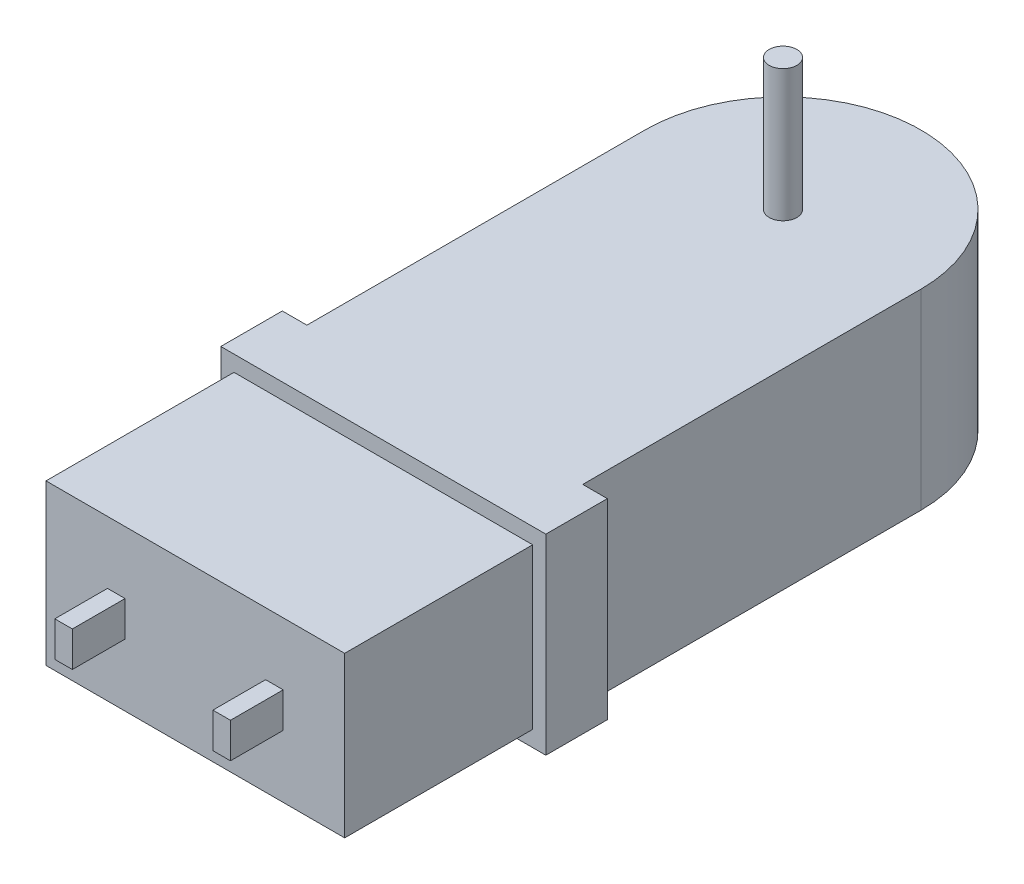
ISO-10303-21;
HEADER;
FILE_DESCRIPTION(('STEP AP214'),'2;1');
FILE_NAME('part.step','',(''),(''),'','','');
FILE_SCHEMA(('AUTOMOTIVE_DESIGN { 1 0 10303 214 1 1 1 1 }'));
ENDSEC;
DATA;
#1=APPLICATION_CONTEXT('core data for automotive mechanical design processes');
#2=APPLICATION_PROTOCOL_DEFINITION('international standard','automotive_design',2000,#1);
#3=PRODUCT_CONTEXT('',#1,'mechanical');
#4=PRODUCT('Part','Part','',(#3));
#5=PRODUCT_RELATED_PRODUCT_CATEGORY('part','',(#4));
#6=PRODUCT_DEFINITION_FORMATION('','',#4);
#7=PRODUCT_DEFINITION_CONTEXT('part definition',#1,'design');
#8=PRODUCT_DEFINITION('design','',#6,#7);
#9=PRODUCT_DEFINITION_SHAPE('','',#8);
#10=(LENGTH_UNIT() NAMED_UNIT(*) SI_UNIT(.MILLI.,.METRE.));
#11=(NAMED_UNIT(*) PLANE_ANGLE_UNIT() SI_UNIT($,.RADIAN.));
#12=(NAMED_UNIT(*) SI_UNIT($,.STERADIAN.) SOLID_ANGLE_UNIT());
#13=UNCERTAINTY_MEASURE_WITH_UNIT(LENGTH_MEASURE(1.E-05),#10,'distance_accuracy_value','');
#14=(GEOMETRIC_REPRESENTATION_CONTEXT(3) GLOBAL_UNCERTAINTY_ASSIGNED_CONTEXT((#13)) GLOBAL_UNIT_ASSIGNED_CONTEXT((#10,
#11,#12)) REPRESENTATION_CONTEXT('',''));
#15=CARTESIAN_POINT('',(0.,0.,0.));
#16=DIRECTION('',(0.,0.,1.));
#17=DIRECTION('',(1.,0.,0.));
#18=AXIS2_PLACEMENT_3D('',#15,#16,#17);
#19=CARTESIAN_POINT('',(5.08,1.27,46.2915));
#20=DIRECTION('',(1.,0.,0.));
#21=DIRECTION('',(0.,0.,-1.));
#22=AXIS2_PLACEMENT_3D('',#19,#20,#21);
#23=PLANE('',#22);
#24=DIRECTION('',(0.,-1.,0.));
#25=VECTOR('',#24,1.);
#26=CARTESIAN_POINT('',(5.08,1.27,42.4815));
#27=LINE('',#26,#25);
#28=CARTESIAN_POINT('',(5.08,1.27,42.4815));
#29=VERTEX_POINT('',#28);
#30=CARTESIAN_POINT('',(5.08,-1.27,42.4815));
#31=VERTEX_POINT('',#30);
#32=EDGE_CURVE('E106',#29,#31,#27,.T.);
#33=ORIENTED_EDGE('',*,*,#32,.T.);
#34=DIRECTION('',(0.,0.,-1.));
#35=VECTOR('',#34,1.);
#36=CARTESIAN_POINT('',(5.08,-1.27,46.2915));
#37=LINE('',#36,#35);
#38=CARTESIAN_POINT('',(5.08,-1.27,46.2915));
#39=VERTEX_POINT('',#38);
#40=EDGE_CURVE('E12',#39,#31,#37,.T.);
#41=ORIENTED_EDGE('',*,*,#40,.F.);
#42=DIRECTION('',(0.,-1.,0.));
#43=VECTOR('',#42,1.);
#44=CARTESIAN_POINT('',(5.08,1.27,46.2915));
#45=LINE('',#44,#43);
#46=CARTESIAN_POINT('',(5.08,1.27,46.2915));
#47=VERTEX_POINT('',#46);
#48=EDGE_CURVE('E94',#47,#39,#45,.T.);
#49=ORIENTED_EDGE('',*,*,#48,.F.);
#50=DIRECTION('',(0.,0.,-1.));
#51=VECTOR('',#50,1.);
#52=CARTESIAN_POINT('',(5.08,1.27,46.2915));
#53=LINE('',#52,#51);
#54=EDGE_CURVE('E102',#47,#29,#53,.T.);
#55=ORIENTED_EDGE('',*,*,#54,.T.);
#56=EDGE_LOOP('',(#33,#41,#49,#55));
#57=FACE_BOUND('',#56,.T.);
#58=ADVANCED_FACE('F43',(#57),#23,.F.);
#59=CARTESIAN_POINT('',(5.08,-1.27,46.2915));
#60=DIRECTION('',(0.,1.,0.));
#61=DIRECTION('',(0.,0.,1.));
#62=AXIS2_PLACEMENT_3D('',#59,#60,#61);
#63=PLANE('',#62);
#64=DIRECTION('',(1.,0.,0.));
#65=VECTOR('',#64,1.);
#66=CARTESIAN_POINT('',(5.08,-1.27,42.4815));
#67=LINE('',#66,#65);
#68=CARTESIAN_POINT('',(6.35,-1.27,42.4815));
#69=VERTEX_POINT('',#68);
#70=EDGE_CURVE('E98',#31,#69,#67,.T.);
#71=ORIENTED_EDGE('',*,*,#70,.T.);
#72=DIRECTION('',(0.,0.,-1.));
#73=VECTOR('',#72,1.);
#74=CARTESIAN_POINT('',(6.35,-1.27,46.2915));
#75=LINE('',#74,#73);
#76=CARTESIAN_POINT('',(6.35,-1.27,46.2915));
#77=VERTEX_POINT('',#76);
#78=EDGE_CURVE('E51',#77,#69,#75,.T.);
#79=ORIENTED_EDGE('',*,*,#78,.F.);
#80=DIRECTION('',(1.,0.,0.));
#81=VECTOR('',#80,1.);
#82=CARTESIAN_POINT('',(5.08,-1.27,46.2915));
#83=LINE('',#82,#81);
#84=EDGE_CURVE('E89',#39,#77,#83,.T.);
#85=ORIENTED_EDGE('',*,*,#84,.F.);
#86=ORIENTED_EDGE('',*,*,#40,.T.);
#87=EDGE_LOOP('',(#71,#79,#85,#86));
#88=FACE_BOUND('',#87,.T.);
#89=ADVANCED_FACE('F97',(#88),#63,.F.);
#90=CARTESIAN_POINT('',(6.35,1.27,46.2915));
#91=DIRECTION('',(-1.,0.,0.));
#92=DIRECTION('',(0.,0.,1.));
#93=AXIS2_PLACEMENT_3D('',#90,#91,#92);
#94=PLANE('',#93);
#95=DIRECTION('',(0.,1.,0.));
#96=VECTOR('',#95,1.);
#97=CARTESIAN_POINT('',(6.35,1.27,42.4815));
#98=LINE('',#97,#96);
#99=CARTESIAN_POINT('',(6.35,1.27,42.4815));
#100=VERTEX_POINT('',#99);
#101=EDGE_CURVE('E76',#69,#100,#98,.T.);
#102=ORIENTED_EDGE('',*,*,#101,.T.);
#103=DIRECTION('',(0.,0.,-1.));
#104=VECTOR('',#103,1.);
#105=CARTESIAN_POINT('',(6.35,1.27,46.2915));
#106=LINE('',#105,#104);
#107=CARTESIAN_POINT('',(6.35,1.27,46.2915));
#108=VERTEX_POINT('',#107);
#109=EDGE_CURVE('E99',#108,#100,#106,.T.);
#110=ORIENTED_EDGE('',*,*,#109,.F.);
#111=DIRECTION('',(0.,1.,0.));
#112=VECTOR('',#111,1.);
#113=CARTESIAN_POINT('',(6.35,1.27,46.2915));
#114=LINE('',#113,#112);
#115=EDGE_CURVE('E92',#77,#108,#114,.T.);
#116=ORIENTED_EDGE('',*,*,#115,.F.);
#117=ORIENTED_EDGE('',*,*,#78,.T.);
#118=EDGE_LOOP('',(#102,#110,#116,#117));
#119=FACE_BOUND('',#118,.T.);
#120=ADVANCED_FACE('F100',(#119),#94,.F.);
#121=CARTESIAN_POINT('',(5.08,1.27,46.2915));
#122=DIRECTION('',(0.,-1.,0.));
#123=DIRECTION('',(0.,0.,-1.));
#124=AXIS2_PLACEMENT_3D('',#121,#122,#123);
#125=PLANE('',#124);
#126=DIRECTION('',(-1.,0.,0.));
#127=VECTOR('',#126,1.);
#128=CARTESIAN_POINT('',(5.08,1.27,42.4815));
#129=LINE('',#128,#127);
#130=EDGE_CURVE('E82',#100,#29,#129,.T.);
#131=ORIENTED_EDGE('',*,*,#130,.T.);
#132=ORIENTED_EDGE('',*,*,#54,.F.);
#133=DIRECTION('',(-1.,0.,0.));
#134=VECTOR('',#133,1.);
#135=CARTESIAN_POINT('',(5.08,1.27,46.2915));
#136=LINE('',#135,#134);
#137=EDGE_CURVE('E59',#108,#47,#136,.T.);
#138=ORIENTED_EDGE('',*,*,#137,.F.);
#139=ORIENTED_EDGE('',*,*,#109,.T.);
#140=EDGE_LOOP('',(#131,#132,#138,#139));
#141=FACE_BOUND('',#140,.T.);
#142=ADVANCED_FACE('F113',(#141),#125,.F.);
#143=CARTESIAN_POINT('',(5.08,-1.27,46.2915));
#144=DIRECTION('',(0.,0.,1.));
#145=DIRECTION('',(1.,0.,0.));
#146=AXIS2_PLACEMENT_3D('',#143,#144,#145);
#147=PLANE('',#146);
#148=ORIENTED_EDGE('',*,*,#48,.T.);
#149=ORIENTED_EDGE('',*,*,#84,.T.);
#150=ORIENTED_EDGE('',*,*,#115,.T.);
#151=ORIENTED_EDGE('',*,*,#137,.T.);
#152=EDGE_LOOP('',(#148,#149,#150,#151));
#153=FACE_BOUND('',#152,.T.);
#154=ADVANCED_FACE('F90',(#153),#147,.T.);
#155=CARTESIAN_POINT('',(5.08,-1.27,42.4815));
#156=DIRECTION('',(0.,0.,1.));
#157=DIRECTION('',(1.,0.,0.));
#158=AXIS2_PLACEMENT_3D('',#155,#156,#157);
#159=PLANE('',#158);
#160=ORIENTED_EDGE('',*,*,#32,.F.);
#161=ORIENTED_EDGE('',*,*,#130,.F.);
#162=ORIENTED_EDGE('',*,*,#101,.F.);
#163=ORIENTED_EDGE('',*,*,#70,.F.);
#164=EDGE_LOOP('',(#160,#161,#162,#163));
#165=FACE_BOUND('',#164,.T.);
#166=ADVANCED_FACE('F116',(#165),#159,.F.);
#167=CLOSED_SHELL('',(#58,#89,#120,#142,#154,#166));
#168=MANIFOLD_SOLID_BREP('B2',#167);
#169=CARTESIAN_POINT('',(-6.35,1.27,46.2915));
#170=DIRECTION('',(1.,0.,0.));
#171=DIRECTION('',(0.,0.,-1.));
#172=AXIS2_PLACEMENT_3D('',#169,#170,#171);
#173=PLANE('',#172);
#174=DIRECTION('',(0.,-1.,0.));
#175=VECTOR('',#174,1.);
#176=CARTESIAN_POINT('',(-6.35,1.27,42.4815));
#177=LINE('',#176,#175);
#178=CARTESIAN_POINT('',(-6.35,1.27,42.4815));
#179=VERTEX_POINT('',#178);
#180=CARTESIAN_POINT('',(-6.35,-1.27,42.4815));
#181=VERTEX_POINT('',#180);
#182=EDGE_CURVE('E237',#179,#181,#177,.T.);
#183=ORIENTED_EDGE('',*,*,#182,.T.);
#184=DIRECTION('',(0.,0.,-1.));
#185=VECTOR('',#184,1.);
#186=CARTESIAN_POINT('',(-6.35,-1.27,46.2915));
#187=LINE('',#186,#185);
#188=CARTESIAN_POINT('',(-6.35,-1.27,46.2915));
#189=VERTEX_POINT('',#188);
#190=EDGE_CURVE('E41',#189,#181,#187,.T.);
#191=ORIENTED_EDGE('',*,*,#190,.F.);
#192=DIRECTION('',(0.,-1.,0.));
#193=VECTOR('',#192,1.);
#194=CARTESIAN_POINT('',(-6.35,1.27,46.2915));
#195=LINE('',#194,#193);
#196=CARTESIAN_POINT('',(-6.35,1.27,46.2915));
#197=VERTEX_POINT('',#196);
#198=EDGE_CURVE('E225',#197,#189,#195,.T.);
#199=ORIENTED_EDGE('',*,*,#198,.F.);
#200=DIRECTION('',(0.,0.,-1.));
#201=VECTOR('',#200,1.);
#202=CARTESIAN_POINT('',(-6.35,1.27,46.2915));
#203=LINE('',#202,#201);
#204=EDGE_CURVE('E233',#197,#179,#203,.T.);
#205=ORIENTED_EDGE('',*,*,#204,.T.);
#206=EDGE_LOOP('',(#183,#191,#199,#205));
#207=FACE_BOUND('',#206,.T.);
#208=ADVANCED_FACE('F174',(#207),#173,.F.);
#209=CARTESIAN_POINT('',(-6.35,-1.27,46.2915));
#210=DIRECTION('',(0.,1.,0.));
#211=DIRECTION('',(0.,0.,1.));
#212=AXIS2_PLACEMENT_3D('',#209,#210,#211);
#213=PLANE('',#212);
#214=DIRECTION('',(1.,0.,0.));
#215=VECTOR('',#214,1.);
#216=CARTESIAN_POINT('',(-6.35,-1.27,42.4815));
#217=LINE('',#216,#215);
#218=CARTESIAN_POINT('',(-5.08,-1.27,42.4815));
#219=VERTEX_POINT('',#218);
#220=EDGE_CURVE('E229',#181,#219,#217,.T.);
#221=ORIENTED_EDGE('',*,*,#220,.T.);
#222=DIRECTION('',(0.,0.,-1.));
#223=VECTOR('',#222,1.);
#224=CARTESIAN_POINT('',(-5.08,-1.27,46.2915));
#225=LINE('',#224,#223);
#226=CARTESIAN_POINT('',(-5.08,-1.27,46.2915));
#227=VERTEX_POINT('',#226);
#228=EDGE_CURVE('E182',#227,#219,#225,.T.);
#229=ORIENTED_EDGE('',*,*,#228,.F.);
#230=DIRECTION('',(1.,0.,0.));
#231=VECTOR('',#230,1.);
#232=CARTESIAN_POINT('',(-6.35,-1.27,46.2915));
#233=LINE('',#232,#231);
#234=EDGE_CURVE('E220',#189,#227,#233,.T.);
#235=ORIENTED_EDGE('',*,*,#234,.F.);
#236=ORIENTED_EDGE('',*,*,#190,.T.);
#237=EDGE_LOOP('',(#221,#229,#235,#236));
#238=FACE_BOUND('',#237,.T.);
#239=ADVANCED_FACE('F228',(#238),#213,.F.);
#240=CARTESIAN_POINT('',(-5.08,1.27,46.2915));
#241=DIRECTION('',(-1.,0.,0.));
#242=DIRECTION('',(0.,0.,1.));
#243=AXIS2_PLACEMENT_3D('',#240,#241,#242);
#244=PLANE('',#243);
#245=DIRECTION('',(0.,1.,0.));
#246=VECTOR('',#245,1.);
#247=CARTESIAN_POINT('',(-5.08,1.27,42.4815));
#248=LINE('',#247,#246);
#249=CARTESIAN_POINT('',(-5.08,1.27,42.4815));
#250=VERTEX_POINT('',#249);
#251=EDGE_CURVE('E207',#219,#250,#248,.T.);
#252=ORIENTED_EDGE('',*,*,#251,.T.);
#253=DIRECTION('',(0.,0.,-1.));
#254=VECTOR('',#253,1.);
#255=CARTESIAN_POINT('',(-5.08,1.27,46.2915));
#256=LINE('',#255,#254);
#257=CARTESIAN_POINT('',(-5.08,1.27,46.2915));
#258=VERTEX_POINT('',#257);
#259=EDGE_CURVE('E230',#258,#250,#256,.T.);
#260=ORIENTED_EDGE('',*,*,#259,.F.);
#261=DIRECTION('',(0.,1.,0.));
#262=VECTOR('',#261,1.);
#263=CARTESIAN_POINT('',(-5.08,1.27,46.2915));
#264=LINE('',#263,#262);
#265=EDGE_CURVE('E223',#227,#258,#264,.T.);
#266=ORIENTED_EDGE('',*,*,#265,.F.);
#267=ORIENTED_EDGE('',*,*,#228,.T.);
#268=EDGE_LOOP('',(#252,#260,#266,#267));
#269=FACE_BOUND('',#268,.T.);
#270=ADVANCED_FACE('F231',(#269),#244,.F.);
#271=CARTESIAN_POINT('',(-6.35,1.27,46.2915));
#272=DIRECTION('',(0.,-1.,0.));
#273=DIRECTION('',(0.,0.,-1.));
#274=AXIS2_PLACEMENT_3D('',#271,#272,#273);
#275=PLANE('',#274);
#276=DIRECTION('',(-1.,0.,0.));
#277=VECTOR('',#276,1.);
#278=CARTESIAN_POINT('',(-6.35,1.27,42.4815));
#279=LINE('',#278,#277);
#280=EDGE_CURVE('E213',#250,#179,#279,.T.);
#281=ORIENTED_EDGE('',*,*,#280,.T.);
#282=ORIENTED_EDGE('',*,*,#204,.F.);
#283=DIRECTION('',(-1.,0.,0.));
#284=VECTOR('',#283,1.);
#285=CARTESIAN_POINT('',(-6.35,1.27,46.2915));
#286=LINE('',#285,#284);
#287=EDGE_CURVE('E190',#258,#197,#286,.T.);
#288=ORIENTED_EDGE('',*,*,#287,.F.);
#289=ORIENTED_EDGE('',*,*,#259,.T.);
#290=EDGE_LOOP('',(#281,#282,#288,#289));
#291=FACE_BOUND('',#290,.T.);
#292=ADVANCED_FACE('F244',(#291),#275,.F.);
#293=CARTESIAN_POINT('',(-6.35,-1.27,46.2915));
#294=DIRECTION('',(0.,0.,1.));
#295=DIRECTION('',(1.,0.,0.));
#296=AXIS2_PLACEMENT_3D('',#293,#294,#295);
#297=PLANE('',#296);
#298=ORIENTED_EDGE('',*,*,#198,.T.);
#299=ORIENTED_EDGE('',*,*,#234,.T.);
#300=ORIENTED_EDGE('',*,*,#265,.T.);
#301=ORIENTED_EDGE('',*,*,#287,.T.);
#302=EDGE_LOOP('',(#298,#299,#300,#301));
#303=FACE_BOUND('',#302,.T.);
#304=ADVANCED_FACE('F221',(#303),#297,.T.);
#305=CARTESIAN_POINT('',(-6.35,-1.27,42.4815));
#306=DIRECTION('',(0.,0.,1.));
#307=DIRECTION('',(1.,0.,0.));
#308=AXIS2_PLACEMENT_3D('',#305,#306,#307);
#309=PLANE('',#308);
#310=ORIENTED_EDGE('',*,*,#182,.F.);
#311=ORIENTED_EDGE('',*,*,#280,.F.);
#312=ORIENTED_EDGE('',*,*,#251,.F.);
#313=ORIENTED_EDGE('',*,*,#220,.F.);
#314=EDGE_LOOP('',(#310,#311,#312,#313));
#315=FACE_BOUND('',#314,.T.);
#316=ADVANCED_FACE('F247',(#315),#309,.F.);
#317=CLOSED_SHELL('',(#208,#239,#270,#292,#304,#316));
#318=MANIFOLD_SOLID_BREP('B6',#317);
#319=CARTESIAN_POINT('',(0.,16.4465,0.));
#320=DIRECTION('',(0.,-1.,0.));
#321=DIRECTION('',(0.,0.,-1.));
#322=AXIS2_PLACEMENT_3D('',#319,#320,#321);
#323=CYLINDRICAL_SURFACE('',#322,1.);
#324=CARTESIAN_POINT('',(0.,16.4465,0.));
#325=DIRECTION('',(0.,1.,0.));
#326=DIRECTION('',(0.,0.,1.));
#327=AXIS2_PLACEMENT_3D('',#324,#325,#326);
#328=CIRCLE('',#327,1.);
#329=CARTESIAN_POINT('',(0.,16.4465,1.));
#330=VERTEX_POINT('',#329);
#331=EDGE_CURVE('E173',#330,#330,#328,.T.);
#332=ORIENTED_EDGE('',*,*,#331,.F.);
#333=EDGE_LOOP('',(#332));
#334=FACE_BOUND('',#333,.T.);
#335=CARTESIAN_POINT('',(0.,6.9215,0.));
#336=DIRECTION('',(0.,1.,0.));
#337=DIRECTION('',(0.,0.,1.));
#338=AXIS2_PLACEMENT_3D('',#335,#336,#337);
#339=CIRCLE('',#338,1.);
#340=CARTESIAN_POINT('',(0.,6.9215,1.));
#341=VERTEX_POINT('',#340);
#342=EDGE_CURVE('E309',#341,#341,#339,.T.);
#343=ORIENTED_EDGE('',*,*,#342,.T.);
#344=EDGE_LOOP('',(#343));
#345=FACE_BOUND('',#344,.T.);
#346=ADVANCED_FACE('F306',(#334,#345),#323,.T.);
#347=CARTESIAN_POINT('',(0.,16.4465,0.));
#348=DIRECTION('',(0.,1.,0.));
#349=DIRECTION('',(0.,0.,1.));
#350=AXIS2_PLACEMENT_3D('',#347,#348,#349);
#351=PLANE('',#350);
#352=ORIENTED_EDGE('',*,*,#331,.T.);
#353=EDGE_LOOP('',(#352));
#354=FACE_BOUND('',#353,.T.);
#355=ADVANCED_FACE('F321',(#354),#351,.T.);
#356=CARTESIAN_POINT('',(0.,6.9215,0.));
#357=DIRECTION('',(0.,1.,0.));
#358=DIRECTION('',(0.,0.,1.));
#359=AXIS2_PLACEMENT_3D('',#356,#357,#358);
#360=PLANE('',#359);
#361=ORIENTED_EDGE('',*,*,#342,.F.);
#362=EDGE_LOOP('',(#361));
#363=FACE_BOUND('',#362,.T.);
#364=ADVANCED_FACE('F319',(#363),#360,.F.);
#365=CLOSED_SHELL('',(#346,#355,#364));
#366=MANIFOLD_SOLID_BREP('B35',#365);
#367=CARTESIAN_POINT('',(10.795,6.9215,28.8925));
#368=DIRECTION('',(-1.,0.,0.));
#369=DIRECTION('',(0.,0.,1.));
#370=AXIS2_PLACEMENT_3D('',#367,#368,#369);
#371=PLANE('',#370);
#372=DIRECTION('',(0.,-1.,0.));
#373=VECTOR('',#372,1.);
#374=CARTESIAN_POINT('',(10.795,6.9215,42.4815));
#375=LINE('',#374,#373);
#376=CARTESIAN_POINT('',(10.795,5.7785,42.4815));
#377=VERTEX_POINT('',#376);
#378=CARTESIAN_POINT('',(10.795,-5.7785,42.4815));
#379=VERTEX_POINT('',#378);
#380=EDGE_CURVE('E440',#377,#379,#375,.T.);
#381=ORIENTED_EDGE('',*,*,#380,.T.);
#382=DIRECTION('',(0.,0.,-1.));
#383=VECTOR('',#382,1.);
#384=CARTESIAN_POINT('',(10.795,-5.7785,28.8925));
#385=LINE('',#384,#383);
#386=CARTESIAN_POINT('',(10.795,-5.7785,28.8925));
#387=VERTEX_POINT('',#386);
#388=EDGE_CURVE('E519',#379,#387,#385,.T.);
#389=ORIENTED_EDGE('',*,*,#388,.T.);
#390=DIRECTION('',(0.,-1.,0.));
#391=VECTOR('',#390,1.);
#392=CARTESIAN_POINT('',(10.795,6.9215,28.8925));
#393=LINE('',#392,#391);
#394=CARTESIAN_POINT('',(10.795,5.7785,28.8925));
#395=VERTEX_POINT('',#394);
#396=EDGE_CURVE('E304',#395,#387,#393,.T.);
#397=ORIENTED_EDGE('',*,*,#396,.F.);
#398=DIRECTION('',(0.,0.,1.));
#399=VECTOR('',#398,1.);
#400=CARTESIAN_POINT('',(10.795,5.7785,28.8925));
#401=LINE('',#400,#399);
#402=EDGE_CURVE('E447',#395,#377,#401,.T.);
#403=ORIENTED_EDGE('',*,*,#402,.T.);
#404=EDGE_LOOP('',(#381,#389,#397,#403));
#405=FACE_BOUND('',#404,.T.);
#406=ADVANCED_FACE('F346',(#405),#371,.F.);
#407=CARTESIAN_POINT('',(11.7475,6.9215,24.4475));
#408=DIRECTION('',(-1.,0.,0.));
#409=DIRECTION('',(0.,0.,1.));
#410=AXIS2_PLACEMENT_3D('',#407,#408,#409);
#411=PLANE('',#410);
#412=DIRECTION('',(0.,0.,-1.));
#413=VECTOR('',#412,1.);
#414=CARTESIAN_POINT('',(11.7475,-6.9215,24.4475));
#415=LINE('',#414,#413);
#416=CARTESIAN_POINT('',(11.7475,-6.9215,28.8925));
#417=VERTEX_POINT('',#416);
#418=CARTESIAN_POINT('',(11.7475,-6.9215,24.4475));
#419=VERTEX_POINT('',#418);
#420=EDGE_CURVE('E444',#417,#419,#415,.T.);
#421=ORIENTED_EDGE('',*,*,#420,.T.);
#422=DIRECTION('',(0.,-1.,0.));
#423=VECTOR('',#422,1.);
#424=CARTESIAN_POINT('',(11.7475,6.9215,24.4475));
#425=LINE('',#424,#423);
#426=CARTESIAN_POINT('',(11.7475,6.9215,24.4475));
#427=VERTEX_POINT('',#426);
#428=EDGE_CURVE('E476',#427,#419,#425,.T.);
#429=ORIENTED_EDGE('',*,*,#428,.F.);
#430=DIRECTION('',(0.,0.,-1.));
#431=VECTOR('',#430,1.);
#432=CARTESIAN_POINT('',(11.7475,6.9215,24.4475));
#433=LINE('',#432,#431);
#434=CARTESIAN_POINT('',(11.7475,6.9215,28.8925));
#435=VERTEX_POINT('',#434);
#436=EDGE_CURVE('E483',#435,#427,#433,.T.);
#437=ORIENTED_EDGE('',*,*,#436,.F.);
#438=DIRECTION('',(0.,-1.,0.));
#439=VECTOR('',#438,1.);
#440=CARTESIAN_POINT('',(11.7475,6.9215,28.8925));
#441=LINE('',#440,#439);
#442=EDGE_CURVE('E354',#435,#417,#441,.T.);
#443=ORIENTED_EDGE('',*,*,#442,.T.);
#444=EDGE_LOOP('',(#421,#429,#437,#443));
#445=FACE_BOUND('',#444,.T.);
#446=ADVANCED_FACE('F480',(#445),#411,.F.);
#447=CARTESIAN_POINT('',(9.9695,6.9215,24.4475));
#448=DIRECTION('',(0.,0.,1.));
#449=DIRECTION('',(1.,0.,0.));
#450=AXIS2_PLACEMENT_3D('',#447,#448,#449);
#451=PLANE('',#450);
#452=DIRECTION('',(-1.,0.,0.));
#453=VECTOR('',#452,1.);
#454=CARTESIAN_POINT('',(9.9695,-6.9215,24.4475));
#455=LINE('',#454,#453);
#456=CARTESIAN_POINT('',(9.9695,-6.9215,24.4475));
#457=VERTEX_POINT('',#456);
#458=EDGE_CURVE('E446',#419,#457,#455,.T.);
#459=ORIENTED_EDGE('',*,*,#458,.T.);
#460=DIRECTION('',(0.,-1.,0.));
#461=VECTOR('',#460,1.);
#462=CARTESIAN_POINT('',(9.9695,6.9215,24.4475));
#463=LINE('',#462,#461);
#464=CARTESIAN_POINT('',(9.9695,6.9215,24.4475));
#465=VERTEX_POINT('',#464);
#466=EDGE_CURVE('E473',#465,#457,#463,.T.);
#467=ORIENTED_EDGE('',*,*,#466,.F.);
#468=DIRECTION('',(-1.,0.,0.));
#469=VECTOR('',#468,1.);
#470=CARTESIAN_POINT('',(9.9695,6.9215,24.4475));
#471=LINE('',#470,#469);
#472=EDGE_CURVE('E502',#427,#465,#471,.T.);
#473=ORIENTED_EDGE('',*,*,#472,.F.);
#474=ORIENTED_EDGE('',*,*,#428,.T.);
#475=EDGE_LOOP('',(#459,#467,#473,#474));
#476=FACE_BOUND('',#475,.T.);
#477=ADVANCED_FACE('F495',(#476),#451,.F.);
#478=CARTESIAN_POINT('',(9.9695,6.9215,0.));
#479=DIRECTION('',(-1.,0.,0.));
#480=DIRECTION('',(0.,0.,1.));
#481=AXIS2_PLACEMENT_3D('',#478,#479,#480);
#482=PLANE('',#481);
#483=DIRECTION('',(0.,0.,-1.));
#484=VECTOR('',#483,1.);
#485=CARTESIAN_POINT('',(9.9695,-6.9215,0.));
#486=LINE('',#485,#484);
#487=CARTESIAN_POINT('',(9.9695,-6.9215,0.));
#488=VERTEX_POINT('',#487);
#489=EDGE_CURVE('E449',#457,#488,#486,.T.);
#490=ORIENTED_EDGE('',*,*,#489,.T.);
#491=DIRECTION('',(0.,-1.,0.));
#492=VECTOR('',#491,1.);
#493=CARTESIAN_POINT('',(9.9695,6.9215,0.));
#494=LINE('',#493,#492);
#495=CARTESIAN_POINT('',(9.9695,6.9215,0.));
#496=VERTEX_POINT('',#495);
#497=EDGE_CURVE('E470',#496,#488,#494,.T.);
#498=ORIENTED_EDGE('',*,*,#497,.F.);
#499=DIRECTION('',(0.,0.,-1.));
#500=VECTOR('',#499,1.);
#501=CARTESIAN_POINT('',(9.9695,6.9215,0.));
#502=LINE('',#501,#500);
#503=EDGE_CURVE('E501',#465,#496,#502,.T.);
#504=ORIENTED_EDGE('',*,*,#503,.F.);
#505=ORIENTED_EDGE('',*,*,#466,.T.);
#506=EDGE_LOOP('',(#490,#498,#504,#505));
#507=FACE_BOUND('',#506,.T.);
#508=ADVANCED_FACE('F499',(#507),#482,.F.);
#509=CARTESIAN_POINT('',(0.,6.9215,0.));
#510=DIRECTION('',(0.,-1.,0.));
#511=DIRECTION('',(0.,0.,-1.));
#512=AXIS2_PLACEMENT_3D('',#509,#510,#511);
#513=CYLINDRICAL_SURFACE('',#512,9.9695);
#514=CARTESIAN_POINT('',(0.,-6.9215,0.));
#515=DIRECTION('',(0.,1.,0.));
#516=DIRECTION('',(0.,0.,1.));
#517=AXIS2_PLACEMENT_3D('',#514,#515,#516);
#518=CIRCLE('',#517,9.9695);
#519=CARTESIAN_POINT('',(-9.9695,-6.9215,0.));
#520=VERTEX_POINT('',#519);
#521=EDGE_CURVE('E451',#488,#520,#518,.T.);
#522=ORIENTED_EDGE('',*,*,#521,.T.);
#523=DIRECTION('',(0.,-1.,0.));
#524=VECTOR('',#523,1.);
#525=CARTESIAN_POINT('',(-9.9695,6.9215,0.));
#526=LINE('',#525,#524);
#527=CARTESIAN_POINT('',(-9.9695,6.9215,0.));
#528=VERTEX_POINT('',#527);
#529=EDGE_CURVE('E433',#528,#520,#526,.T.);
#530=ORIENTED_EDGE('',*,*,#529,.F.);
#531=CARTESIAN_POINT('',(0.,6.9215,0.));
#532=DIRECTION('',(0.,1.,0.));
#533=DIRECTION('',(0.,0.,1.));
#534=AXIS2_PLACEMENT_3D('',#531,#532,#533);
#535=CIRCLE('',#534,9.9695);
#536=EDGE_CURVE('E424',#496,#528,#535,.T.);
#537=ORIENTED_EDGE('',*,*,#536,.F.);
#538=ORIENTED_EDGE('',*,*,#497,.T.);
#539=EDGE_LOOP('',(#522,#530,#537,#538));
#540=FACE_BOUND('',#539,.T.);
#541=ADVANCED_FACE('F585',(#540),#513,.T.);
#542=CARTESIAN_POINT('',(-9.9695,6.9215,0.));
#543=DIRECTION('',(1.,0.,0.));
#544=DIRECTION('',(0.,0.,-1.));
#545=AXIS2_PLACEMENT_3D('',#542,#543,#544);
#546=PLANE('',#545);
#547=DIRECTION('',(0.,0.,1.));
#548=VECTOR('',#547,1.);
#549=CARTESIAN_POINT('',(-9.9695,-6.9215,0.));
#550=LINE('',#549,#548);
#551=CARTESIAN_POINT('',(-9.9695,-6.9215,24.4475));
#552=VERTEX_POINT('',#551);
#553=EDGE_CURVE('E432',#520,#552,#550,.T.);
#554=ORIENTED_EDGE('',*,*,#553,.T.);
#555=DIRECTION('',(0.,-1.,0.));
#556=VECTOR('',#555,1.);
#557=CARTESIAN_POINT('',(-9.9695,6.9215,24.4475));
#558=LINE('',#557,#556);
#559=CARTESIAN_POINT('',(-9.9695,6.9215,24.4475));
#560=VERTEX_POINT('',#559);
#561=EDGE_CURVE('E429',#560,#552,#558,.T.);
#562=ORIENTED_EDGE('',*,*,#561,.F.);
#563=DIRECTION('',(0.,0.,1.));
#564=VECTOR('',#563,1.);
#565=CARTESIAN_POINT('',(-9.9695,6.9215,0.));
#566=LINE('',#565,#564);
#567=EDGE_CURVE('E418',#528,#560,#566,.T.);
#568=ORIENTED_EDGE('',*,*,#567,.F.);
#569=ORIENTED_EDGE('',*,*,#529,.T.);
#570=EDGE_LOOP('',(#554,#562,#568,#569));
#571=FACE_BOUND('',#570,.T.);
#572=ADVANCED_FACE('F430',(#571),#546,.F.);
#573=CARTESIAN_POINT('',(-9.9695,6.9215,24.4475));
#574=DIRECTION('',(0.,0.,1.));
#575=DIRECTION('',(1.,0.,0.));
#576=AXIS2_PLACEMENT_3D('',#573,#574,#575);
#577=PLANE('',#576);
#578=DIRECTION('',(-1.,0.,0.));
#579=VECTOR('',#578,1.);
#580=CARTESIAN_POINT('',(-9.9695,-6.9215,24.4475));
#581=LINE('',#580,#579);
#582=CARTESIAN_POINT('',(-11.7475,-6.9215,24.4475));
#583=VERTEX_POINT('',#582);
#584=EDGE_CURVE('E393',#552,#583,#581,.T.);
#585=ORIENTED_EDGE('',*,*,#584,.T.);
#586=DIRECTION('',(0.,-1.,0.));
#587=VECTOR('',#586,1.);
#588=CARTESIAN_POINT('',(-11.7475,6.9215,24.4475));
#589=LINE('',#588,#587);
#590=CARTESIAN_POINT('',(-11.7475,6.9215,24.4475));
#591=VERTEX_POINT('',#590);
#592=EDGE_CURVE('E434',#591,#583,#589,.T.);
#593=ORIENTED_EDGE('',*,*,#592,.F.);
#594=DIRECTION('',(-1.,0.,0.));
#595=VECTOR('',#594,1.);
#596=CARTESIAN_POINT('',(-9.9695,6.9215,24.4475));
#597=LINE('',#596,#595);
#598=EDGE_CURVE('E422',#560,#591,#597,.T.);
#599=ORIENTED_EDGE('',*,*,#598,.F.);
#600=ORIENTED_EDGE('',*,*,#561,.T.);
#601=EDGE_LOOP('',(#585,#593,#599,#600));
#602=FACE_BOUND('',#601,.T.);
#603=ADVANCED_FACE('F436',(#602),#577,.F.);
#604=CARTESIAN_POINT('',(-11.7475,6.9215,24.4475));
#605=DIRECTION('',(1.,0.,0.));
#606=DIRECTION('',(0.,0.,-1.));
#607=AXIS2_PLACEMENT_3D('',#604,#605,#606);
#608=PLANE('',#607);
#609=DIRECTION('',(0.,0.,1.));
#610=VECTOR('',#609,1.);
#611=CARTESIAN_POINT('',(-11.7475,-6.9215,24.4475));
#612=LINE('',#611,#610);
#613=CARTESIAN_POINT('',(-11.7475,-6.9215,28.8925));
#614=VERTEX_POINT('',#613);
#615=EDGE_CURVE('E455',#583,#614,#612,.T.);
#616=ORIENTED_EDGE('',*,*,#615,.T.);
#617=DIRECTION('',(0.,-1.,0.));
#618=VECTOR('',#617,1.);
#619=CARTESIAN_POINT('',(-11.7475,6.9215,28.8925));
#620=LINE('',#619,#618);
#621=CARTESIAN_POINT('',(-11.7475,6.9215,28.8925));
#622=VERTEX_POINT('',#621);
#623=EDGE_CURVE('E398',#622,#614,#620,.T.);
#624=ORIENTED_EDGE('',*,*,#623,.F.);
#625=DIRECTION('',(0.,0.,1.));
#626=VECTOR('',#625,1.);
#627=CARTESIAN_POINT('',(-11.7475,6.9215,24.4475));
#628=LINE('',#627,#626);
#629=EDGE_CURVE('E438',#591,#622,#628,.T.);
#630=ORIENTED_EDGE('',*,*,#629,.F.);
#631=ORIENTED_EDGE('',*,*,#592,.T.);
#632=EDGE_LOOP('',(#616,#624,#630,#631));
#633=FACE_BOUND('',#632,.T.);
#634=ADVANCED_FACE('F565',(#633),#608,.F.);
#635=CARTESIAN_POINT('',(-11.7475,6.9215,28.8925));
#636=DIRECTION('',(0.,0.,-1.));
#637=DIRECTION('',(-1.,0.,0.));
#638=AXIS2_PLACEMENT_3D('',#635,#636,#637);
#639=PLANE('',#638);
#640=DIRECTION('',(1.,0.,0.));
#641=VECTOR('',#640,1.);
#642=CARTESIAN_POINT('',(-11.7475,-6.9215,28.8925));
#643=LINE('',#642,#641);
#644=EDGE_CURVE('E457',#614,#417,#643,.T.);
#645=ORIENTED_EDGE('',*,*,#644,.T.);
#646=ORIENTED_EDGE('',*,*,#442,.F.);
#647=DIRECTION('',(1.,0.,0.));
#648=VECTOR('',#647,1.);
#649=CARTESIAN_POINT('',(11.7475,6.9215,28.8925));
#650=LINE('',#649,#648);
#651=EDGE_CURVE('E362',#622,#435,#650,.T.);
#652=ORIENTED_EDGE('',*,*,#651,.F.);
#653=ORIENTED_EDGE('',*,*,#623,.T.);
#654=EDGE_LOOP('',(#645,#646,#652,#653));
#655=FACE_BOUND('',#654,.T.);
#656=ORIENTED_EDGE('',*,*,#396,.T.);
#657=DIRECTION('',(-1.,0.,0.));
#658=VECTOR('',#657,1.);
#659=CARTESIAN_POINT('',(-11.7475,-5.7785,28.8925));
#660=LINE('',#659,#658);
#661=CARTESIAN_POINT('',(-10.795,-5.7785,28.8925));
#662=VERTEX_POINT('',#661);
#663=EDGE_CURVE('E525',#387,#662,#660,.T.);
#664=ORIENTED_EDGE('',*,*,#663,.T.);
#665=DIRECTION('',(0.,-1.,0.));
#666=VECTOR('',#665,1.);
#667=CARTESIAN_POINT('',(-10.795,6.9215,28.8925));
#668=LINE('',#667,#666);
#669=CARTESIAN_POINT('',(-10.795,5.7785,28.8925));
#670=VERTEX_POINT('',#669);
#671=EDGE_CURVE('E464',#670,#662,#668,.T.);
#672=ORIENTED_EDGE('',*,*,#671,.F.);
#673=DIRECTION('',(1.,0.,0.));
#674=VECTOR('',#673,1.);
#675=CARTESIAN_POINT('',(-11.7475,5.7785,28.8925));
#676=LINE('',#675,#674);
#677=EDGE_CURVE('E513',#670,#395,#676,.T.);
#678=ORIENTED_EDGE('',*,*,#677,.T.);
#679=EDGE_LOOP('',(#656,#664,#672,#678));
#680=FACE_BOUND('',#679,.T.);
#681=ADVANCED_FACE('F485',(#655,#680),#639,.F.);
#682=CARTESIAN_POINT('',(-10.795,6.9215,28.8925));
#683=DIRECTION('',(1.,0.,0.));
#684=DIRECTION('',(0.,0.,-1.));
#685=AXIS2_PLACEMENT_3D('',#682,#683,#684);
#686=PLANE('',#685);
#687=ORIENTED_EDGE('',*,*,#671,.T.);
#688=DIRECTION('',(0.,0.,1.));
#689=VECTOR('',#688,1.);
#690=CARTESIAN_POINT('',(-10.795,-5.7785,28.8925));
#691=LINE('',#690,#689);
#692=CARTESIAN_POINT('',(-10.795,-5.7785,42.4815));
#693=VERTEX_POINT('',#692);
#694=EDGE_CURVE('E522',#662,#693,#691,.T.);
#695=ORIENTED_EDGE('',*,*,#694,.T.);
#696=DIRECTION('',(0.,-1.,0.));
#697=VECTOR('',#696,1.);
#698=CARTESIAN_POINT('',(-10.795,6.9215,42.4815));
#699=LINE('',#698,#697);
#700=CARTESIAN_POINT('',(-10.795,5.7785,42.4815));
#701=VERTEX_POINT('',#700);
#702=EDGE_CURVE('E461',#701,#693,#699,.T.);
#703=ORIENTED_EDGE('',*,*,#702,.F.);
#704=DIRECTION('',(0.,0.,-1.));
#705=VECTOR('',#704,1.);
#706=CARTESIAN_POINT('',(-10.795,5.7785,28.8925));
#707=LINE('',#706,#705);
#708=EDGE_CURVE('E510',#701,#670,#707,.T.);
#709=ORIENTED_EDGE('',*,*,#708,.T.);
#710=EDGE_LOOP('',(#687,#695,#703,#709));
#711=FACE_BOUND('',#710,.T.);
#712=ADVANCED_FACE('F545',(#711),#686,.F.);
#713=CARTESIAN_POINT('',(-10.795,6.9215,42.4815));
#714=DIRECTION('',(0.,0.,-1.));
#715=DIRECTION('',(-1.,0.,0.));
#716=AXIS2_PLACEMENT_3D('',#713,#714,#715);
#717=PLANE('',#716);
#718=ORIENTED_EDGE('',*,*,#702,.T.);
#719=DIRECTION('',(-1.,0.,0.));
#720=VECTOR('',#719,1.);
#721=CARTESIAN_POINT('',(-11.7475,-5.7785,42.4815));
#722=LINE('',#721,#720);
#723=EDGE_CURVE('E528',#379,#693,#722,.T.);
#724=ORIENTED_EDGE('',*,*,#723,.F.);
#725=ORIENTED_EDGE('',*,*,#380,.F.);
#726=DIRECTION('',(1.,0.,0.));
#727=VECTOR('',#726,1.);
#728=CARTESIAN_POINT('',(-11.7475,5.7785,42.4815));
#729=LINE('',#728,#727);
#730=EDGE_CURVE('E516',#701,#377,#729,.T.);
#731=ORIENTED_EDGE('',*,*,#730,.F.);
#732=EDGE_LOOP('',(#718,#724,#725,#731));
#733=FACE_BOUND('',#732,.T.);
#734=ADVANCED_FACE('F549',(#733),#717,.F.);
#735=CARTESIAN_POINT('',(0.,6.9215,0.));
#736=DIRECTION('',(0.,1.,0.));
#737=DIRECTION('',(0.,0.,1.));
#738=AXIS2_PLACEMENT_3D('',#735,#736,#737);
#739=PLANE('',#738);
#740=ORIENTED_EDGE('',*,*,#629,.T.);
#741=ORIENTED_EDGE('',*,*,#651,.T.);
#742=ORIENTED_EDGE('',*,*,#436,.T.);
#743=ORIENTED_EDGE('',*,*,#472,.T.);
#744=ORIENTED_EDGE('',*,*,#503,.T.);
#745=ORIENTED_EDGE('',*,*,#536,.T.);
#746=ORIENTED_EDGE('',*,*,#567,.T.);
#747=ORIENTED_EDGE('',*,*,#598,.T.);
#748=EDGE_LOOP('',(#740,#741,#742,#743,#744,#745,#746,#747));
#749=FACE_BOUND('',#748,.T.);
#750=ADVANCED_FACE('F420',(#749),#739,.T.);
#751=CARTESIAN_POINT('',(0.,-6.9215,0.));
#752=DIRECTION('',(0.,1.,0.));
#753=DIRECTION('',(0.,0.,1.));
#754=AXIS2_PLACEMENT_3D('',#751,#752,#753);
#755=PLANE('',#754);
#756=ORIENTED_EDGE('',*,*,#420,.F.);
#757=ORIENTED_EDGE('',*,*,#644,.F.);
#758=ORIENTED_EDGE('',*,*,#615,.F.);
#759=ORIENTED_EDGE('',*,*,#584,.F.);
#760=ORIENTED_EDGE('',*,*,#553,.F.);
#761=ORIENTED_EDGE('',*,*,#521,.F.);
#762=ORIENTED_EDGE('',*,*,#489,.F.);
#763=ORIENTED_EDGE('',*,*,#458,.F.);
#764=EDGE_LOOP('',(#756,#757,#758,#759,#760,#761,#762,#763));
#765=FACE_BOUND('',#764,.T.);
#766=ADVANCED_FACE('F490',(#765),#755,.F.);
#767=CARTESIAN_POINT('',(-11.7475,5.7785,5.36971372796156));
#768=DIRECTION('',(0.,-1.,0.));
#769=DIRECTION('',(0.,0.,-1.));
#770=AXIS2_PLACEMENT_3D('',#767,#768,#769);
#771=PLANE('',#770);
#772=ORIENTED_EDGE('',*,*,#677,.F.);
#773=ORIENTED_EDGE('',*,*,#708,.F.);
#774=ORIENTED_EDGE('',*,*,#730,.T.);
#775=ORIENTED_EDGE('',*,*,#402,.F.);
#776=EDGE_LOOP('',(#772,#773,#774,#775));
#777=FACE_BOUND('',#776,.T.);
#778=ADVANCED_FACE('F556',(#777),#771,.F.);
#779=CARTESIAN_POINT('',(-11.7475,-5.7785,5.36971372796156));
#780=DIRECTION('',(0.,1.,0.));
#781=DIRECTION('',(0.,0.,1.));
#782=AXIS2_PLACEMENT_3D('',#779,#780,#781);
#783=PLANE('',#782);
#784=ORIENTED_EDGE('',*,*,#723,.T.);
#785=ORIENTED_EDGE('',*,*,#694,.F.);
#786=ORIENTED_EDGE('',*,*,#663,.F.);
#787=ORIENTED_EDGE('',*,*,#388,.F.);
#788=EDGE_LOOP('',(#784,#785,#786,#787));
#789=FACE_BOUND('',#788,.T.);
#790=ADVANCED_FACE('F535',(#789),#783,.F.);
#791=CLOSED_SHELL('',(#406,#446,#477,#508,#541,#572,#603,#634,#681,#712,#734,#750,#766,#778,#790));
#792=MANIFOLD_SOLID_BREP('B168',#791);
#793=ADVANCED_BREP_SHAPE_REPRESENTATION('',(#18,#168,#318,#366,#792),#14);
#794=SHAPE_DEFINITION_REPRESENTATION(#9,#793);
ENDSEC;
END-ISO-10303-21;
